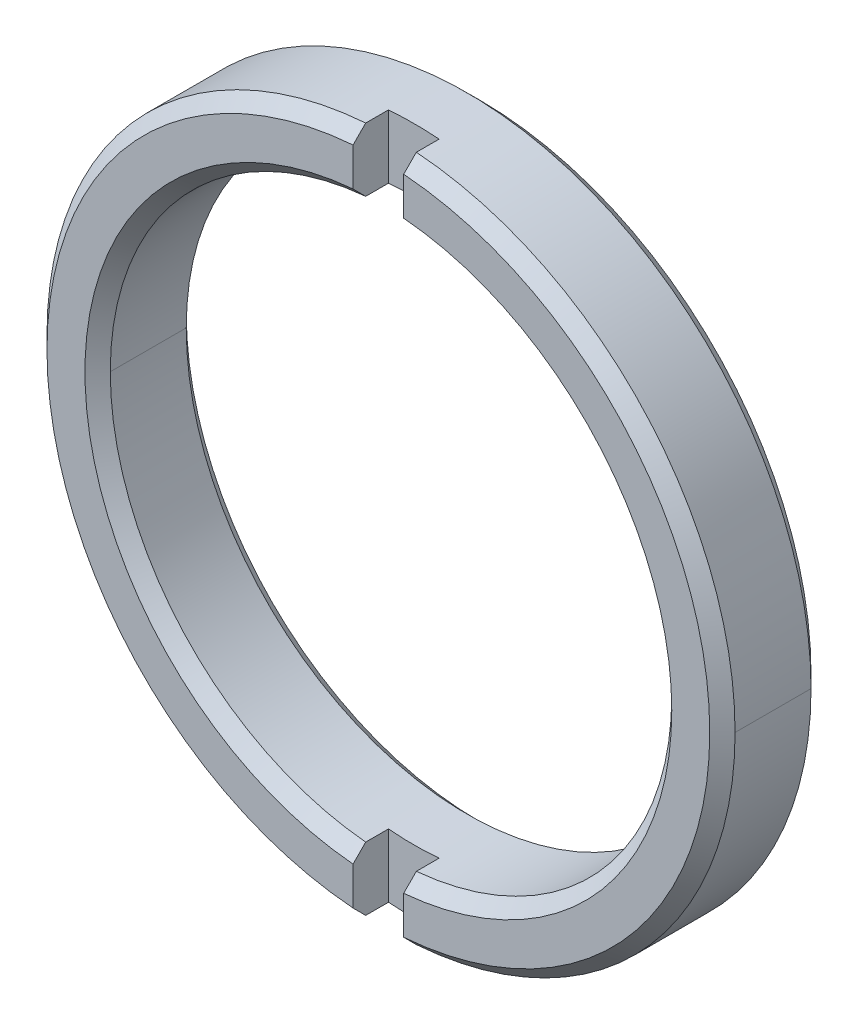
ISO-10303-21;
HEADER;
FILE_DESCRIPTION(('STEP AP214'),'2;1');
FILE_NAME('part.step','',(''),(''),'','','');
FILE_SCHEMA(('AUTOMOTIVE_DESIGN { 1 0 10303 214 1 1 1 1 }'));
ENDSEC;
DATA;
#1=APPLICATION_CONTEXT('core data for automotive mechanical design processes');
#2=APPLICATION_PROTOCOL_DEFINITION('international standard','automotive_design',2000,#1);
#3=PRODUCT_CONTEXT('',#1,'mechanical');
#4=PRODUCT('Part','Part','',(#3));
#5=PRODUCT_RELATED_PRODUCT_CATEGORY('part','',(#4));
#6=PRODUCT_DEFINITION_FORMATION('','',#4);
#7=PRODUCT_DEFINITION_CONTEXT('part definition',#1,'design');
#8=PRODUCT_DEFINITION('design','',#6,#7);
#9=PRODUCT_DEFINITION_SHAPE('','',#8);
#10=(LENGTH_UNIT() NAMED_UNIT(*) SI_UNIT(.MILLI.,.METRE.));
#11=(NAMED_UNIT(*) PLANE_ANGLE_UNIT() SI_UNIT($,.RADIAN.));
#12=(NAMED_UNIT(*) SI_UNIT($,.STERADIAN.) SOLID_ANGLE_UNIT());
#13=UNCERTAINTY_MEASURE_WITH_UNIT(LENGTH_MEASURE(1.E-05),#10,'distance_accuracy_value','');
#14=(GEOMETRIC_REPRESENTATION_CONTEXT(3) GLOBAL_UNCERTAINTY_ASSIGNED_CONTEXT((#13)) GLOBAL_UNIT_ASSIGNED_CONTEXT((#10,
#11,#12)) REPRESENTATION_CONTEXT('',''));
#15=CARTESIAN_POINT('',(0.,0.,0.));
#16=DIRECTION('',(0.,0.,1.));
#17=DIRECTION('',(1.,0.,0.));
#18=AXIS2_PLACEMENT_3D('',#15,#16,#17);
#19=CARTESIAN_POINT('',(-0.500000000000007,55.,1.3));
#20=DIRECTION('',(-1.,0.,0.));
#21=DIRECTION('',(0.,1.,0.));
#22=AXIS2_PLACEMENT_3D('',#19,#20,#21);
#23=PLANE('',#22);
#24=DIRECTION('',(0.,0.,-1.));
#25=VECTOR('',#24,1.);
#26=CARTESIAN_POINT('',(-0.5,5.52190911279786,2.));
#27=LINE('',#26,#25);
#28=CARTESIAN_POINT('',(-0.5,5.52190911279786,1.75));
#29=VERTEX_POINT('',#28);
#30=CARTESIAN_POINT('',(-0.5,5.52190911279786,1.3));
#31=VERTEX_POINT('',#30);
#32=EDGE_CURVE('E257',#29,#31,#27,.T.);
#33=ORIENTED_EDGE('',*,*,#32,.T.);
#34=DIRECTION('',(0.,-1.,0.));
#35=VECTOR('',#34,1.);
#36=CARTESIAN_POINT('',(-0.500000000000007,55.,1.3));
#37=LINE('',#36,#35);
#38=CARTESIAN_POINT('',(-0.5,6.77607779249914,1.3));
#39=VERTEX_POINT('',#38);
#40=EDGE_CURVE('E25',#39,#31,#37,.T.);
#41=ORIENTED_EDGE('',*,*,#40,.F.);
#42=DIRECTION('',(0.,0.,-1.));
#43=VECTOR('',#42,1.);
#44=CARTESIAN_POINT('',(-0.5,6.77607779249914,2.));
#45=LINE('',#44,#43);
#46=CARTESIAN_POINT('',(-0.5,6.77607779249914,1.75));
#47=VERTEX_POINT('',#46);
#48=EDGE_CURVE('E183',#47,#39,#45,.T.);
#49=ORIENTED_EDGE('',*,*,#48,.F.);
#50=CARTESIAN_POINT('',(-0.5,6.77607779249914,1.75));
#51=CARTESIAN_POINT('',(-0.5,6.69251354093146,1.83333768037303));
#52=CARTESIAN_POINT('',(-0.5,6.60894512249002,1.91667118024032));
#53=CARTESIAN_POINT('',(-0.5,6.52537203920206,2.));
#54=(BOUNDED_CURVE() B_SPLINE_CURVE(3,(#50,#51,#52,#53),.UNSPECIFIED.,.F.,
.F.) B_SPLINE_CURVE_WITH_KNOTS((4,4),(0.011539991428633,0.011894044205025),
.UNSPECIFIED.) CURVE() GEOMETRIC_REPRESENTATION_ITEM() RATIONAL_B_SPLINE_CURVE((1.,1.,1.,1.)) REPRESENTATION_ITEM(''));
#55=CARTESIAN_POINT('',(-0.5,6.52537203920206,2.));
#56=VERTEX_POINT('',#55);
#57=EDGE_CURVE('E178',#47,#56,#54,.T.);
#58=ORIENTED_EDGE('',*,*,#57,.T.);
#59=DIRECTION('',(0.,-1.,0.));
#60=VECTOR('',#59,1.);
#61=CARTESIAN_POINT('',(-0.500000000000007,55.,2.));
#62=LINE('',#61,#60);
#63=CARTESIAN_POINT('',(-0.5,5.77288751406088,2.));
#64=VERTEX_POINT('',#63);
#65=EDGE_CURVE('E181',#56,#64,#62,.T.);
#66=ORIENTED_EDGE('',*,*,#65,.T.);
#67=CARTESIAN_POINT('',(-0.5,5.77288751406088,2.));
#68=CARTESIAN_POINT('',(-0.5,5.68923509342954,1.91665958847465));
#69=CARTESIAN_POINT('',(-0.5,5.60557594533339,1.83332593471311));
#70=CARTESIAN_POINT('',(-0.5,5.52190911279786,1.75));
#71=(BOUNDED_CURVE() B_SPLINE_CURVE(3,(#67,#68,#69,#70),.UNSPECIFIED.,.F.,
.F.) B_SPLINE_CURVE_WITH_KNOTS((4,4),(0.00984450423718629,0.0101987501222222),
.UNSPECIFIED.) CURVE() GEOMETRIC_REPRESENTATION_ITEM() RATIONAL_B_SPLINE_CURVE((1.,1.,1.,1.)) REPRESENTATION_ITEM(''));
#72=EDGE_CURVE('E40',#64,#29,#71,.T.);
#73=ORIENTED_EDGE('',*,*,#72,.T.);
#74=EDGE_LOOP('',(#33,#41,#49,#58,#66,#73));
#75=FACE_BOUND('',#74,.T.);
#76=ADVANCED_FACE('F14',(#75),#23,.F.);
#77=CARTESIAN_POINT('',(0.499999999999993,55.,1.3));
#78=DIRECTION('',(1.,0.,0.));
#79=DIRECTION('',(0.,1.,0.));
#80=AXIS2_PLACEMENT_3D('',#77,#78,#79);
#81=PLANE('',#80);
#82=DIRECTION('',(0.,0.,1.));
#83=VECTOR('',#82,1.);
#84=CARTESIAN_POINT('',(0.5,5.52190911279786,2.));
#85=LINE('',#84,#83);
#86=CARTESIAN_POINT('',(0.5,5.52190911279786,1.3));
#87=VERTEX_POINT('',#86);
#88=CARTESIAN_POINT('',(0.5,5.52190911279786,1.75));
#89=VERTEX_POINT('',#88);
#90=EDGE_CURVE('E368',#87,#89,#85,.T.);
#91=ORIENTED_EDGE('',*,*,#90,.T.);
#92=CARTESIAN_POINT('',(0.5,5.52190911279786,1.75));
#93=CARTESIAN_POINT('',(0.5,5.60557594889368,1.83332593825891));
#94=CARTESIAN_POINT('',(0.5,5.68923509683505,1.91665959186746));
#95=CARTESIAN_POINT('',(0.5,5.77288751406088,2.));
#96=(BOUNDED_CURVE() B_SPLINE_CURVE(3,(#92,#93,#94,#95),.UNSPECIFIED.,.F.,
.F.) B_SPLINE_CURVE_WITH_KNOTS((4,4),(0.0252588448888443,0.025613630062761),
.UNSPECIFIED.) CURVE() GEOMETRIC_REPRESENTATION_ITEM() RATIONAL_B_SPLINE_CURVE((1.,1.,1.,1.)) REPRESENTATION_ITEM(''));
#97=CARTESIAN_POINT('',(0.5,5.77288751406088,2.));
#98=VERTEX_POINT('',#97);
#99=EDGE_CURVE('E224',#89,#98,#96,.T.);
#100=ORIENTED_EDGE('',*,*,#99,.T.);
#101=DIRECTION('',(0.,1.,0.));
#102=VECTOR('',#101,1.);
#103=CARTESIAN_POINT('',(0.499999999999993,55.,2.));
#104=LINE('',#103,#102);
#105=CARTESIAN_POINT('',(0.5,6.52537203920206,2.));
#106=VERTEX_POINT('',#105);
#107=EDGE_CURVE('E316',#98,#106,#104,.T.);
#108=ORIENTED_EDGE('',*,*,#107,.T.);
#109=CARTESIAN_POINT('',(0.5,6.52537203920206,2.));
#110=CARTESIAN_POINT('',(0.5,6.60894512643388,1.916671176308));
#111=CARTESIAN_POINT('',(0.5,6.6925135447294,1.83333767658539));
#112=CARTESIAN_POINT('',(0.5,6.77607779249914,1.75));
#113=(BOUNDED_CURVE() B_SPLINE_CURVE(3,(#109,#110,#111,#112),.UNSPECIFIED.,.F.,
.F.) B_SPLINE_CURVE_WITH_KNOTS((4,4),(0.0297927476213285,0.0301474759784899),
.UNSPECIFIED.) CURVE() GEOMETRIC_REPRESENTATION_ITEM() RATIONAL_B_SPLINE_CURVE((1.,1.,1.,1.)) REPRESENTATION_ITEM(''));
#114=CARTESIAN_POINT('',(0.5,6.77607779249914,1.75));
#115=VERTEX_POINT('',#114);
#116=EDGE_CURVE('E208',#106,#115,#113,.T.);
#117=ORIENTED_EDGE('',*,*,#116,.T.);
#118=DIRECTION('',(0.,0.,1.));
#119=VECTOR('',#118,1.);
#120=CARTESIAN_POINT('',(0.5,6.77607779249914,2.));
#121=LINE('',#120,#119);
#122=CARTESIAN_POINT('',(0.5,6.77607779249914,1.3));
#123=VERTEX_POINT('',#122);
#124=EDGE_CURVE('E429',#123,#115,#121,.T.);
#125=ORIENTED_EDGE('',*,*,#124,.F.);
#126=DIRECTION('',(0.,1.,0.));
#127=VECTOR('',#126,1.);
#128=CARTESIAN_POINT('',(0.499999999999993,55.,1.3));
#129=LINE('',#128,#127);
#130=EDGE_CURVE('E9',#87,#123,#129,.T.);
#131=ORIENTED_EDGE('',*,*,#130,.F.);
#132=EDGE_LOOP('',(#91,#100,#108,#117,#125,#131));
#133=FACE_BOUND('',#132,.T.);
#134=ADVANCED_FACE('F597',(#133),#81,.F.);
#135=CARTESIAN_POINT('',(0.,0.,1.3));
#136=DIRECTION('',(0.,0.,1.));
#137=DIRECTION('',(1.,0.,0.));
#138=AXIS2_PLACEMENT_3D('',#135,#136,#137);
#139=PLANE('',#138);
#140=CARTESIAN_POINT('',(0.,0.,1.3));
#141=DIRECTION('',(0.,0.,1.));
#142=DIRECTION('',(1.,0.,0.));
#143=AXIS2_PLACEMENT_3D('',#140,#141,#142);
#144=CIRCLE('',#143,6.7945);
#145=EDGE_CURVE('E426',#123,#39,#144,.T.);
#146=ORIENTED_EDGE('',*,*,#145,.T.);
#147=ORIENTED_EDGE('',*,*,#40,.T.);
#148=CARTESIAN_POINT('',(0.,0.,1.3));
#149=DIRECTION('',(0.,0.,1.));
#150=DIRECTION('',(1.,0.,0.));
#151=AXIS2_PLACEMENT_3D('',#148,#149,#150);
#152=CIRCLE('',#151,5.5445);
#153=EDGE_CURVE('E310',#87,#31,#152,.T.);
#154=ORIENTED_EDGE('',*,*,#153,.F.);
#155=ORIENTED_EDGE('',*,*,#130,.T.);
#156=EDGE_LOOP('',(#146,#147,#154,#155));
#157=FACE_BOUND('',#156,.T.);
#158=ADVANCED_FACE('F573',(#157),#139,.T.);
#159=CARTESIAN_POINT('',(0.,0.,1.3));
#160=DIRECTION('',(0.,0.,1.));
#161=DIRECTION('',(1.,0.,0.));
#162=AXIS2_PLACEMENT_3D('',#159,#160,#161);
#163=PLANE('',#162);
#164=CARTESIAN_POINT('',(0.,0.,1.3));
#165=DIRECTION('',(0.,0.,1.));
#166=DIRECTION('',(1.,0.,0.));
#167=AXIS2_PLACEMENT_3D('',#164,#165,#166);
#168=CIRCLE('',#167,6.7945);
#169=CARTESIAN_POINT('',(-0.5,-6.77607779249914,1.3));
#170=VERTEX_POINT('',#169);
#171=CARTESIAN_POINT('',(0.5,-6.77607779249914,1.3));
#172=VERTEX_POINT('',#171);
#173=EDGE_CURVE('E425',#170,#172,#168,.T.);
#174=ORIENTED_EDGE('',*,*,#173,.T.);
#175=DIRECTION('',(0.,1.,0.));
#176=VECTOR('',#175,1.);
#177=CARTESIAN_POINT('',(0.499999999999993,55.,1.3));
#178=LINE('',#177,#176);
#179=CARTESIAN_POINT('',(0.5,-5.52190911279786,1.3));
#180=VERTEX_POINT('',#179);
#181=EDGE_CURVE('E187',#172,#180,#178,.T.);
#182=ORIENTED_EDGE('',*,*,#181,.T.);
#183=CARTESIAN_POINT('',(0.,0.,1.3));
#184=DIRECTION('',(0.,0.,1.));
#185=DIRECTION('',(1.,0.,0.));
#186=AXIS2_PLACEMENT_3D('',#183,#184,#185);
#187=CIRCLE('',#186,5.5445);
#188=CARTESIAN_POINT('',(-0.5,-5.52190911279786,1.3));
#189=VERTEX_POINT('',#188);
#190=EDGE_CURVE('E300',#189,#180,#187,.T.);
#191=ORIENTED_EDGE('',*,*,#190,.F.);
#192=DIRECTION('',(0.,-1.,0.));
#193=VECTOR('',#192,1.);
#194=CARTESIAN_POINT('',(-0.500000000000007,55.,1.3));
#195=LINE('',#194,#193);
#196=EDGE_CURVE('E227',#189,#170,#195,.T.);
#197=ORIENTED_EDGE('',*,*,#196,.T.);
#198=EDGE_LOOP('',(#174,#182,#191,#197));
#199=FACE_BOUND('',#198,.T.);
#200=ADVANCED_FACE('F568',(#199),#163,.T.);
#201=CARTESIAN_POINT('',(-0.500000000000007,55.,1.3));
#202=DIRECTION('',(-1.,0.,0.));
#203=DIRECTION('',(0.,1.,0.));
#204=AXIS2_PLACEMENT_3D('',#201,#202,#203);
#205=PLANE('',#204);
#206=DIRECTION('',(0.,0.,1.));
#207=VECTOR('',#206,1.);
#208=CARTESIAN_POINT('',(-0.5,-5.52190911279786,2.));
#209=LINE('',#208,#207);
#210=CARTESIAN_POINT('',(-0.5,-5.52190911279786,1.75));
#211=VERTEX_POINT('',#210);
#212=EDGE_CURVE('E289',#189,#211,#209,.T.);
#213=ORIENTED_EDGE('',*,*,#212,.T.);
#214=CARTESIAN_POINT('',(-0.5,-5.52190911279786,1.75));
#215=CARTESIAN_POINT('',(-0.5,-5.60557594889368,1.83332593825891));
#216=CARTESIAN_POINT('',(-0.5,-5.68923509683505,1.91665959186746));
#217=CARTESIAN_POINT('',(-0.5,-5.77288751406088,2.));
#218=(BOUNDED_CURVE() B_SPLINE_CURVE(3,(#214,#215,#216,#217),.UNSPECIFIED.,.F.,
.F.) B_SPLINE_CURVE_WITH_KNOTS((4,4),(0.0252588448888443,0.025613630062761),
.UNSPECIFIED.) CURVE() GEOMETRIC_REPRESENTATION_ITEM() RATIONAL_B_SPLINE_CURVE((1.,1.,1.,1.)) REPRESENTATION_ITEM(''));
#219=CARTESIAN_POINT('',(-0.5,-5.77288751406088,2.));
#220=VERTEX_POINT('',#219);
#221=EDGE_CURVE('E188',#211,#220,#218,.T.);
#222=ORIENTED_EDGE('',*,*,#221,.T.);
#223=DIRECTION('',(0.,-1.,0.));
#224=VECTOR('',#223,1.);
#225=CARTESIAN_POINT('',(-0.500000000000007,55.,2.));
#226=LINE('',#225,#224);
#227=CARTESIAN_POINT('',(-0.5,-6.52537203920206,2.));
#228=VERTEX_POINT('',#227);
#229=EDGE_CURVE('E200',#220,#228,#226,.T.);
#230=ORIENTED_EDGE('',*,*,#229,.T.);
#231=CARTESIAN_POINT('',(-0.5,-6.52537203920206,2.));
#232=CARTESIAN_POINT('',(-0.5,-6.60894512643388,1.916671176308));
#233=CARTESIAN_POINT('',(-0.5,-6.6925135447294,1.83333767658539));
#234=CARTESIAN_POINT('',(-0.5,-6.77607779249914,1.75));
#235=(BOUNDED_CURVE() B_SPLINE_CURVE(3,(#231,#232,#233,#234),.UNSPECIFIED.,.F.,
.F.) B_SPLINE_CURVE_WITH_KNOTS((4,4),(0.0297927476213285,0.0301474759784899),
.UNSPECIFIED.) CURVE() GEOMETRIC_REPRESENTATION_ITEM() RATIONAL_B_SPLINE_CURVE((1.,1.,1.,1.)) REPRESENTATION_ITEM(''));
#236=CARTESIAN_POINT('',(-0.5,-6.77607779249914,1.75));
#237=VERTEX_POINT('',#236);
#238=EDGE_CURVE('E336',#228,#237,#235,.T.);
#239=ORIENTED_EDGE('',*,*,#238,.T.);
#240=DIRECTION('',(0.,0.,1.));
#241=VECTOR('',#240,1.);
#242=CARTESIAN_POINT('',(-0.5,-6.77607779249914,2.));
#243=LINE('',#242,#241);
#244=EDGE_CURVE('E401',#170,#237,#243,.T.);
#245=ORIENTED_EDGE('',*,*,#244,.F.);
#246=ORIENTED_EDGE('',*,*,#196,.F.);
#247=EDGE_LOOP('',(#213,#222,#230,#239,#245,#246));
#248=FACE_BOUND('',#247,.T.);
#249=ADVANCED_FACE('F572',(#248),#205,.F.);
#250=CARTESIAN_POINT('',(0.499999999999993,55.,1.3));
#251=DIRECTION('',(1.,0.,0.));
#252=DIRECTION('',(0.,1.,0.));
#253=AXIS2_PLACEMENT_3D('',#250,#251,#252);
#254=PLANE('',#253);
#255=DIRECTION('',(0.,0.,-1.));
#256=VECTOR('',#255,1.);
#257=CARTESIAN_POINT('',(0.5,-5.52190911279786,2.));
#258=LINE('',#257,#256);
#259=CARTESIAN_POINT('',(0.5,-5.52190911279786,1.75));
#260=VERTEX_POINT('',#259);
#261=EDGE_CURVE('E374',#260,#180,#258,.T.);
#262=ORIENTED_EDGE('',*,*,#261,.T.);
#263=ORIENTED_EDGE('',*,*,#181,.F.);
#264=DIRECTION('',(0.,0.,-1.));
#265=VECTOR('',#264,1.);
#266=CARTESIAN_POINT('',(0.5,-6.77607779249914,2.));
#267=LINE('',#266,#265);
#268=CARTESIAN_POINT('',(0.5,-6.77607779249914,1.75));
#269=VERTEX_POINT('',#268);
#270=EDGE_CURVE('E420',#269,#172,#267,.T.);
#271=ORIENTED_EDGE('',*,*,#270,.F.);
#272=CARTESIAN_POINT('',(0.5,-6.77607779249914,1.75));
#273=CARTESIAN_POINT('',(0.5,-6.69251354093146,1.83333768037303));
#274=CARTESIAN_POINT('',(0.5,-6.60894512249002,1.91667118024032));
#275=CARTESIAN_POINT('',(0.5,-6.52537203920206,2.));
#276=(BOUNDED_CURVE() B_SPLINE_CURVE(3,(#272,#273,#274,#275),.UNSPECIFIED.,.F.,
.F.) B_SPLINE_CURVE_WITH_KNOTS((4,4),(0.011539991428633,0.011894044205025),
.UNSPECIFIED.) CURVE() GEOMETRIC_REPRESENTATION_ITEM() RATIONAL_B_SPLINE_CURVE((1.,1.,1.,1.)) REPRESENTATION_ITEM(''));
#277=CARTESIAN_POINT('',(0.5,-6.52537203920206,2.));
#278=VERTEX_POINT('',#277);
#279=EDGE_CURVE('E317',#269,#278,#276,.T.);
#280=ORIENTED_EDGE('',*,*,#279,.T.);
#281=DIRECTION('',(0.,1.,0.));
#282=VECTOR('',#281,1.);
#283=CARTESIAN_POINT('',(0.499999999999993,55.,2.));
#284=LINE('',#283,#282);
#285=CARTESIAN_POINT('',(0.5,-5.77288751406088,2.));
#286=VERTEX_POINT('',#285);
#287=EDGE_CURVE('E229',#278,#286,#284,.T.);
#288=ORIENTED_EDGE('',*,*,#287,.T.);
#289=CARTESIAN_POINT('',(0.5,-5.77288751406088,2.));
#290=CARTESIAN_POINT('',(0.5,-5.68923509342954,1.91665958847465));
#291=CARTESIAN_POINT('',(0.5,-5.60557594533339,1.83332593471311));
#292=CARTESIAN_POINT('',(0.5,-5.52190911279786,1.75));
#293=(BOUNDED_CURVE() B_SPLINE_CURVE(3,(#289,#290,#291,#292),.UNSPECIFIED.,.F.,
.F.) B_SPLINE_CURVE_WITH_KNOTS((4,4),(0.00984450423718629,0.0101987501222222),
.UNSPECIFIED.) CURVE() GEOMETRIC_REPRESENTATION_ITEM() RATIONAL_B_SPLINE_CURVE((1.,1.,1.,1.)) REPRESENTATION_ITEM(''));
#294=EDGE_CURVE('E315',#286,#260,#293,.T.);
#295=ORIENTED_EDGE('',*,*,#294,.T.);
#296=EDGE_LOOP('',(#262,#263,#271,#280,#288,#295));
#297=FACE_BOUND('',#296,.T.);
#298=ADVANCED_FACE('F619',(#297),#254,.F.);
#299=CARTESIAN_POINT('',(0.,0.,2.));
#300=DIRECTION('',(0.,0.,-1.));
#301=DIRECTION('',(-1.,0.,0.));
#302=AXIS2_PLACEMENT_3D('',#299,#300,#301);
#303=CONICAL_SURFACE('',#302,6.5445,0.78539816339745);
#304=DIRECTION('',(-0.707106781186549,0.,-0.707106781186546));
#305=VECTOR('',#304,1.);
#306=CARTESIAN_POINT('',(-6.5445,0.,2.));
#307=LINE('',#306,#305);
#308=CARTESIAN_POINT('',(-6.5445,0.,2.));
#309=VERTEX_POINT('',#308);
#310=CARTESIAN_POINT('',(-6.7945,0.,1.75));
#311=VERTEX_POINT('',#310);
#312=EDGE_CURVE('E195',#309,#311,#307,.T.);
#313=ORIENTED_EDGE('',*,*,#312,.F.);
#314=CARTESIAN_POINT('',(0.,0.,2.));
#315=DIRECTION('',(0.,0.,1.));
#316=DIRECTION('',(1.,0.,0.));
#317=AXIS2_PLACEMENT_3D('',#314,#315,#316);
#318=CIRCLE('',#317,6.5445);
#319=EDGE_CURVE('E192',#56,#309,#318,.T.);
#320=ORIENTED_EDGE('',*,*,#319,.F.);
#321=ORIENTED_EDGE('',*,*,#57,.F.);
#322=CARTESIAN_POINT('',(0.,0.,1.75));
#323=DIRECTION('',(0.,0.,-1.));
#324=DIRECTION('',(1.,0.,0.));
#325=AXIS2_PLACEMENT_3D('',#322,#323,#324);
#326=CIRCLE('',#325,6.7945);
#327=EDGE_CURVE('E355',#311,#47,#326,.T.);
#328=ORIENTED_EDGE('',*,*,#327,.F.);
#329=EDGE_LOOP('',(#313,#320,#321,#328));
#330=FACE_BOUND('',#329,.T.);
#331=ADVANCED_FACE('F193',(#330),#303,.T.);
#332=CARTESIAN_POINT('',(0.,0.,0.25));
#333=DIRECTION('',(0.,0.,1.));
#334=DIRECTION('',(1.,0.,0.));
#335=AXIS2_PLACEMENT_3D('',#332,#333,#334);
#336=CONICAL_SURFACE('',#335,6.7945,0.78539816339745);
#337=DIRECTION('',(-0.707106781186549,0.,0.707106781186546));
#338=VECTOR('',#337,1.);
#339=CARTESIAN_POINT('',(-6.7945,0.,0.25));
#340=LINE('',#339,#338);
#341=CARTESIAN_POINT('',(-6.5445,0.,0.));
#342=VERTEX_POINT('',#341);
#343=CARTESIAN_POINT('',(-6.7945,0.,0.25));
#344=VERTEX_POINT('',#343);
#345=EDGE_CURVE('E267',#342,#344,#340,.T.);
#346=ORIENTED_EDGE('',*,*,#345,.F.);
#347=CARTESIAN_POINT('',(0.,0.,0.));
#348=DIRECTION('',(0.,0.,-1.));
#349=DIRECTION('',(1.,0.,0.));
#350=AXIS2_PLACEMENT_3D('',#347,#348,#349);
#351=CIRCLE('',#350,6.5445);
#352=CARTESIAN_POINT('',(6.5445,0.,0.));
#353=VERTEX_POINT('',#352);
#354=EDGE_CURVE('E356',#353,#342,#351,.T.);
#355=ORIENTED_EDGE('',*,*,#354,.F.);
#356=DIRECTION('',(0.707106781186549,0.,0.707106781186546));
#357=VECTOR('',#356,1.);
#358=CARTESIAN_POINT('',(6.7945,0.,0.25));
#359=LINE('',#358,#357);
#360=CARTESIAN_POINT('',(6.7945,0.,0.25));
#361=VERTEX_POINT('',#360);
#362=EDGE_CURVE('E266',#353,#361,#359,.T.);
#363=ORIENTED_EDGE('',*,*,#362,.T.);
#364=CARTESIAN_POINT('',(0.,0.,0.25));
#365=DIRECTION('',(0.,0.,1.));
#366=DIRECTION('',(1.,0.,0.));
#367=AXIS2_PLACEMENT_3D('',#364,#365,#366);
#368=CIRCLE('',#367,6.7945);
#369=EDGE_CURVE('E396',#344,#361,#368,.T.);
#370=ORIENTED_EDGE('',*,*,#369,.F.);
#371=EDGE_LOOP('',(#346,#355,#363,#370));
#372=FACE_BOUND('',#371,.T.);
#373=ADVANCED_FACE('F588',(#372),#336,.T.);
#374=CARTESIAN_POINT('',(0.,0.,0.));
#375=DIRECTION('',(0.,0.,-1.));
#376=DIRECTION('',(-1.,0.,0.));
#377=AXIS2_PLACEMENT_3D('',#374,#375,#376);
#378=CONICAL_SURFACE('',#377,5.7945,0.785398163397448);
#379=DIRECTION('',(0.707106781186548,0.,-0.707106781186548));
#380=VECTOR('',#379,1.);
#381=CARTESIAN_POINT('',(5.7945,0.,0.));
#382=LINE('',#381,#380);
#383=CARTESIAN_POINT('',(5.5445,0.,0.25));
#384=VERTEX_POINT('',#383);
#385=CARTESIAN_POINT('',(5.7945,0.,0.));
#386=VERTEX_POINT('',#385);
#387=EDGE_CURVE('E335',#384,#386,#382,.T.);
#388=ORIENTED_EDGE('',*,*,#387,.F.);
#389=CARTESIAN_POINT('',(0.,0.,0.25));
#390=DIRECTION('',(0.,0.,-1.));
#391=DIRECTION('',(1.,0.,0.));
#392=AXIS2_PLACEMENT_3D('',#389,#390,#391);
#393=CIRCLE('',#392,5.5445);
#394=CARTESIAN_POINT('',(-5.5445,0.,0.25));
#395=VERTEX_POINT('',#394);
#396=EDGE_CURVE('E236',#395,#384,#393,.T.);
#397=ORIENTED_EDGE('',*,*,#396,.F.);
#398=DIRECTION('',(-0.707106781186548,0.,-0.707106781186548));
#399=VECTOR('',#398,1.);
#400=CARTESIAN_POINT('',(-5.7945,0.,0.));
#401=LINE('',#400,#399);
#402=CARTESIAN_POINT('',(-5.7945,0.,0.));
#403=VERTEX_POINT('',#402);
#404=EDGE_CURVE('E334',#395,#403,#401,.T.);
#405=ORIENTED_EDGE('',*,*,#404,.T.);
#406=CARTESIAN_POINT('',(0.,0.,0.));
#407=DIRECTION('',(0.,0.,1.));
#408=DIRECTION('',(1.,0.,0.));
#409=AXIS2_PLACEMENT_3D('',#406,#407,#408);
#410=CIRCLE('',#409,5.7945);
#411=EDGE_CURVE('E359',#386,#403,#410,.T.);
#412=ORIENTED_EDGE('',*,*,#411,.F.);
#413=EDGE_LOOP('',(#388,#397,#405,#412));
#414=FACE_BOUND('',#413,.T.);
#415=ADVANCED_FACE('F16',(#414),#378,.F.);
#416=CARTESIAN_POINT('',(0.,0.,1.75));
#417=DIRECTION('',(0.,0.,1.));
#418=DIRECTION('',(1.,0.,0.));
#419=AXIS2_PLACEMENT_3D('',#416,#417,#418);
#420=CONICAL_SURFACE('',#419,5.5445,0.785398163397448);
#421=ORIENTED_EDGE('',*,*,#72,.F.);
#422=CARTESIAN_POINT('',(0.,0.,2.));
#423=DIRECTION('',(0.,0.,-1.));
#424=DIRECTION('',(1.,0.,0.));
#425=AXIS2_PLACEMENT_3D('',#422,#423,#424);
#426=CIRCLE('',#425,5.7945);
#427=EDGE_CURVE('E206',#220,#64,#426,.T.);
#428=ORIENTED_EDGE('',*,*,#427,.F.);
#429=ORIENTED_EDGE('',*,*,#221,.F.);
#430=CARTESIAN_POINT('',(0.,0.,1.75));
#431=DIRECTION('',(0.,0.,1.));
#432=DIRECTION('',(1.,0.,0.));
#433=AXIS2_PLACEMENT_3D('',#430,#431,#432);
#434=CIRCLE('',#433,5.5445);
#435=CARTESIAN_POINT('',(-5.5445,0.,1.75));
#436=VERTEX_POINT('',#435);
#437=EDGE_CURVE('E282',#436,#211,#434,.T.);
#438=ORIENTED_EDGE('',*,*,#437,.F.);
#439=CARTESIAN_POINT('',(0.,0.,1.75));
#440=DIRECTION('',(0.,0.,1.));
#441=DIRECTION('',(1.,0.,0.));
#442=AXIS2_PLACEMENT_3D('',#439,#440,#441);
#443=CIRCLE('',#442,5.5445);
#444=EDGE_CURVE('E246',#29,#436,#443,.T.);
#445=ORIENTED_EDGE('',*,*,#444,.F.);
#446=EDGE_LOOP('',(#421,#428,#429,#438,#445));
#447=FACE_BOUND('',#446,.T.);
#448=ADVANCED_FACE('F606',(#447),#420,.F.);
#449=CARTESIAN_POINT('',(0.,0.,2.));
#450=DIRECTION('',(0.,0.,-1.));
#451=DIRECTION('',(-1.,0.,0.));
#452=AXIS2_PLACEMENT_3D('',#449,#450,#451);
#453=CYLINDRICAL_SURFACE('',#452,5.5445);
#454=DIRECTION('',(0.,0.,-1.));
#455=VECTOR('',#454,1.);
#456=CARTESIAN_POINT('',(5.5445,0.,2.));
#457=LINE('',#456,#455);
#458=CARTESIAN_POINT('',(5.5445,0.,1.75));
#459=VERTEX_POINT('',#458);
#460=EDGE_CURVE('E278',#459,#384,#457,.T.);
#461=ORIENTED_EDGE('',*,*,#460,.F.);
#462=CARTESIAN_POINT('',(0.,0.,1.75));
#463=DIRECTION('',(0.,0.,1.));
#464=DIRECTION('',(1.,0.,0.));
#465=AXIS2_PLACEMENT_3D('',#462,#463,#464);
#466=CIRCLE('',#465,5.5445);
#467=EDGE_CURVE('E261',#459,#89,#466,.T.);
#468=ORIENTED_EDGE('',*,*,#467,.T.);
#469=ORIENTED_EDGE('',*,*,#90,.F.);
#470=ORIENTED_EDGE('',*,*,#153,.T.);
#471=ORIENTED_EDGE('',*,*,#32,.F.);
#472=ORIENTED_EDGE('',*,*,#444,.T.);
#473=DIRECTION('',(0.,0.,-1.));
#474=VECTOR('',#473,1.);
#475=CARTESIAN_POINT('',(-5.5445,0.,2.));
#476=LINE('',#475,#474);
#477=EDGE_CURVE('E280',#436,#395,#476,.T.);
#478=ORIENTED_EDGE('',*,*,#477,.T.);
#479=ORIENTED_EDGE('',*,*,#396,.T.);
#480=EDGE_LOOP('',(#461,#468,#469,#470,#471,#472,#478,#479));
#481=FACE_BOUND('',#480,.T.);
#482=ADVANCED_FACE('F610',(#481),#453,.F.);
#483=CARTESIAN_POINT('',(0.,0.,2.));
#484=DIRECTION('',(0.,0.,-1.));
#485=DIRECTION('',(-1.,0.,0.));
#486=AXIS2_PLACEMENT_3D('',#483,#484,#485);
#487=CYLINDRICAL_SURFACE('',#486,6.7945);
#488=DIRECTION('',(0.,0.,-1.));
#489=VECTOR('',#488,1.);
#490=CARTESIAN_POINT('',(6.7945,0.,2.));
#491=LINE('',#490,#489);
#492=CARTESIAN_POINT('',(6.7945,0.,1.75));
#493=VERTEX_POINT('',#492);
#494=EDGE_CURVE('E272',#493,#361,#491,.T.);
#495=ORIENTED_EDGE('',*,*,#494,.F.);
#496=CARTESIAN_POINT('',(0.,0.,1.75));
#497=DIRECTION('',(0.,0.,-1.));
#498=DIRECTION('',(1.,0.,0.));
#499=AXIS2_PLACEMENT_3D('',#496,#497,#498);
#500=CIRCLE('',#499,6.7945);
#501=EDGE_CURVE('E215',#493,#269,#500,.T.);
#502=ORIENTED_EDGE('',*,*,#501,.T.);
#503=ORIENTED_EDGE('',*,*,#270,.T.);
#504=ORIENTED_EDGE('',*,*,#173,.F.);
#505=ORIENTED_EDGE('',*,*,#244,.T.);
#506=CARTESIAN_POINT('',(0.,0.,1.75));
#507=DIRECTION('',(0.,0.,-1.));
#508=DIRECTION('',(1.,0.,0.));
#509=AXIS2_PLACEMENT_3D('',#506,#507,#508);
#510=CIRCLE('',#509,6.7945);
#511=EDGE_CURVE('E342',#237,#311,#510,.T.);
#512=ORIENTED_EDGE('',*,*,#511,.T.);
#513=DIRECTION('',(0.,0.,-1.));
#514=VECTOR('',#513,1.);
#515=CARTESIAN_POINT('',(-6.7945,0.,2.));
#516=LINE('',#515,#514);
#517=EDGE_CURVE('E276',#311,#344,#516,.T.);
#518=ORIENTED_EDGE('',*,*,#517,.T.);
#519=ORIENTED_EDGE('',*,*,#369,.T.);
#520=EDGE_LOOP('',(#495,#502,#503,#504,#505,#512,#518,#519));
#521=FACE_BOUND('',#520,.T.);
#522=ADVANCED_FACE('F656',(#521),#487,.T.);
#523=CARTESIAN_POINT('',(0.,0.,0.));
#524=DIRECTION('',(0.,0.,1.));
#525=DIRECTION('',(1.,0.,0.));
#526=AXIS2_PLACEMENT_3D('',#523,#524,#525);
#527=PLANE('',#526);
#528=CARTESIAN_POINT('',(0.,0.,0.));
#529=DIRECTION('',(0.,0.,1.));
#530=DIRECTION('',(1.,0.,0.));
#531=AXIS2_PLACEMENT_3D('',#528,#529,#530);
#532=CIRCLE('',#531,5.7945);
#533=EDGE_CURVE('E327',#403,#386,#532,.T.);
#534=ORIENTED_EDGE('',*,*,#533,.T.);
#535=ORIENTED_EDGE('',*,*,#411,.T.);
#536=EDGE_LOOP('',(#534,#535));
#537=FACE_BOUND('',#536,.T.);
#538=ORIENTED_EDGE('',*,*,#354,.T.);
#539=CARTESIAN_POINT('',(0.,0.,0.));
#540=DIRECTION('',(0.,0.,-1.));
#541=DIRECTION('',(1.,0.,0.));
#542=AXIS2_PLACEMENT_3D('',#539,#540,#541);
#543=CIRCLE('',#542,6.5445);
#544=EDGE_CURVE('E270',#342,#353,#543,.T.);
#545=ORIENTED_EDGE('',*,*,#544,.T.);
#546=EDGE_LOOP('',(#538,#545));
#547=FACE_BOUND('',#546,.T.);
#548=ADVANCED_FACE('F583',(#537,#547),#527,.F.);
#549=CARTESIAN_POINT('',(0.,0.,2.));
#550=DIRECTION('',(0.,0.,1.));
#551=DIRECTION('',(1.,0.,0.));
#552=AXIS2_PLACEMENT_3D('',#549,#550,#551);
#553=PLANE('',#552);
#554=ORIENTED_EDGE('',*,*,#65,.F.);
#555=ORIENTED_EDGE('',*,*,#319,.T.);
#556=CARTESIAN_POINT('',(0.,0.,2.));
#557=DIRECTION('',(0.,0.,1.));
#558=DIRECTION('',(1.,0.,0.));
#559=AXIS2_PLACEMENT_3D('',#556,#557,#558);
#560=CIRCLE('',#559,6.5445);
#561=EDGE_CURVE('E304',#309,#228,#560,.T.);
#562=ORIENTED_EDGE('',*,*,#561,.T.);
#563=ORIENTED_EDGE('',*,*,#229,.F.);
#564=ORIENTED_EDGE('',*,*,#427,.T.);
#565=EDGE_LOOP('',(#554,#555,#562,#563,#564));
#566=FACE_BOUND('',#565,.T.);
#567=ADVANCED_FACE('F203',(#566),#553,.T.);
#568=CARTESIAN_POINT('',(0.,0.,2.));
#569=DIRECTION('',(0.,0.,-1.));
#570=DIRECTION('',(-1.,0.,0.));
#571=AXIS2_PLACEMENT_3D('',#568,#569,#570);
#572=CONICAL_SURFACE('',#571,6.5445,0.78539816339745);
#573=ORIENTED_EDGE('',*,*,#279,.F.);
#574=ORIENTED_EDGE('',*,*,#501,.F.);
#575=CARTESIAN_POINT('',(0.,0.,1.75));
#576=DIRECTION('',(0.,0.,-1.));
#577=DIRECTION('',(1.,0.,0.));
#578=AXIS2_PLACEMENT_3D('',#575,#576,#577);
#579=CIRCLE('',#578,6.7945);
#580=EDGE_CURVE('E277',#115,#493,#579,.T.);
#581=ORIENTED_EDGE('',*,*,#580,.F.);
#582=ORIENTED_EDGE('',*,*,#116,.F.);
#583=CARTESIAN_POINT('',(0.,0.,2.));
#584=DIRECTION('',(0.,0.,1.));
#585=DIRECTION('',(1.,0.,0.));
#586=AXIS2_PLACEMENT_3D('',#583,#584,#585);
#587=CIRCLE('',#586,6.5445);
#588=EDGE_CURVE('E232',#278,#106,#587,.T.);
#589=ORIENTED_EDGE('',*,*,#588,.F.);
#590=EDGE_LOOP('',(#573,#574,#581,#582,#589));
#591=FACE_BOUND('',#590,.T.);
#592=ADVANCED_FACE('F582',(#591),#572,.T.);
#593=CARTESIAN_POINT('',(0.,0.,1.75));
#594=DIRECTION('',(0.,0.,1.));
#595=DIRECTION('',(1.,0.,0.));
#596=AXIS2_PLACEMENT_3D('',#593,#594,#595);
#597=CONICAL_SURFACE('',#596,5.5445,0.785398163397448);
#598=DIRECTION('',(0.707106781186548,0.,0.707106781186548));
#599=VECTOR('',#598,1.);
#600=CARTESIAN_POINT('',(5.5445,0.,1.75));
#601=LINE('',#600,#599);
#602=CARTESIAN_POINT('',(5.7945,0.,2.));
#603=VERTEX_POINT('',#602);
#604=EDGE_CURVE('E225',#459,#603,#601,.T.);
#605=ORIENTED_EDGE('',*,*,#604,.F.);
#606=CARTESIAN_POINT('',(0.,0.,1.75));
#607=DIRECTION('',(0.,0.,1.));
#608=DIRECTION('',(1.,0.,0.));
#609=AXIS2_PLACEMENT_3D('',#606,#607,#608);
#610=CIRCLE('',#609,5.5445);
#611=EDGE_CURVE('E219',#260,#459,#610,.T.);
#612=ORIENTED_EDGE('',*,*,#611,.F.);
#613=ORIENTED_EDGE('',*,*,#294,.F.);
#614=CARTESIAN_POINT('',(0.,0.,2.));
#615=DIRECTION('',(0.,0.,-1.));
#616=DIRECTION('',(1.,0.,0.));
#617=AXIS2_PLACEMENT_3D('',#614,#615,#616);
#618=CIRCLE('',#617,5.7945);
#619=EDGE_CURVE('E311',#603,#286,#618,.T.);
#620=ORIENTED_EDGE('',*,*,#619,.F.);
#621=EDGE_LOOP('',(#605,#612,#613,#620));
#622=FACE_BOUND('',#621,.T.);
#623=ADVANCED_FACE('F635',(#622),#597,.F.);
#624=CARTESIAN_POINT('',(0.,0.,2.));
#625=DIRECTION('',(0.,0.,1.));
#626=DIRECTION('',(1.,0.,0.));
#627=AXIS2_PLACEMENT_3D('',#624,#625,#626);
#628=PLANE('',#627);
#629=ORIENTED_EDGE('',*,*,#287,.F.);
#630=ORIENTED_EDGE('',*,*,#588,.T.);
#631=ORIENTED_EDGE('',*,*,#107,.F.);
#632=CARTESIAN_POINT('',(0.,0.,2.));
#633=DIRECTION('',(0.,0.,-1.));
#634=DIRECTION('',(1.,0.,0.));
#635=AXIS2_PLACEMENT_3D('',#632,#633,#634);
#636=CIRCLE('',#635,5.7945);
#637=EDGE_CURVE('E221',#98,#603,#636,.T.);
#638=ORIENTED_EDGE('',*,*,#637,.T.);
#639=ORIENTED_EDGE('',*,*,#619,.T.);
#640=EDGE_LOOP('',(#629,#630,#631,#638,#639));
#641=FACE_BOUND('',#640,.T.);
#642=ADVANCED_FACE('F639',(#641),#628,.T.);
#643=CARTESIAN_POINT('',(0.,0.,1.75));
#644=DIRECTION('',(0.,0.,1.));
#645=DIRECTION('',(1.,0.,0.));
#646=AXIS2_PLACEMENT_3D('',#643,#644,#645);
#647=CONICAL_SURFACE('',#646,5.5445,0.785398163397448);
#648=ORIENTED_EDGE('',*,*,#467,.F.);
#649=ORIENTED_EDGE('',*,*,#604,.T.);
#650=ORIENTED_EDGE('',*,*,#637,.F.);
#651=ORIENTED_EDGE('',*,*,#99,.F.);
#652=EDGE_LOOP('',(#648,#649,#650,#651));
#653=FACE_BOUND('',#652,.T.);
#654=ADVANCED_FACE('F629',(#653),#647,.F.);
#655=CARTESIAN_POINT('',(0.,0.,2.));
#656=DIRECTION('',(0.,0.,-1.));
#657=DIRECTION('',(-1.,0.,0.));
#658=AXIS2_PLACEMENT_3D('',#655,#656,#657);
#659=CYLINDRICAL_SURFACE('',#658,6.7945);
#660=ORIENTED_EDGE('',*,*,#580,.T.);
#661=ORIENTED_EDGE('',*,*,#494,.T.);
#662=CARTESIAN_POINT('',(0.,0.,0.25));
#663=DIRECTION('',(0.,0.,1.));
#664=DIRECTION('',(1.,0.,0.));
#665=AXIS2_PLACEMENT_3D('',#662,#663,#664);
#666=CIRCLE('',#665,6.7945);
#667=EDGE_CURVE('E263',#361,#344,#666,.T.);
#668=ORIENTED_EDGE('',*,*,#667,.T.);
#669=ORIENTED_EDGE('',*,*,#517,.F.);
#670=ORIENTED_EDGE('',*,*,#327,.T.);
#671=ORIENTED_EDGE('',*,*,#48,.T.);
#672=ORIENTED_EDGE('',*,*,#145,.F.);
#673=ORIENTED_EDGE('',*,*,#124,.T.);
#674=EDGE_LOOP('',(#660,#661,#668,#669,#670,#671,#672,#673));
#675=FACE_BOUND('',#674,.T.);
#676=ADVANCED_FACE('F624',(#675),#659,.T.);
#677=CARTESIAN_POINT('',(0.,0.,2.));
#678=DIRECTION('',(0.,0.,-1.));
#679=DIRECTION('',(-1.,0.,0.));
#680=AXIS2_PLACEMENT_3D('',#677,#678,#679);
#681=CYLINDRICAL_SURFACE('',#680,5.5445);
#682=ORIENTED_EDGE('',*,*,#611,.T.);
#683=ORIENTED_EDGE('',*,*,#460,.T.);
#684=CARTESIAN_POINT('',(0.,0.,0.25));
#685=DIRECTION('',(0.,0.,-1.));
#686=DIRECTION('',(1.,0.,0.));
#687=AXIS2_PLACEMENT_3D('',#684,#685,#686);
#688=CIRCLE('',#687,5.5445);
#689=EDGE_CURVE('E18',#384,#395,#688,.T.);
#690=ORIENTED_EDGE('',*,*,#689,.T.);
#691=ORIENTED_EDGE('',*,*,#477,.F.);
#692=ORIENTED_EDGE('',*,*,#437,.T.);
#693=ORIENTED_EDGE('',*,*,#212,.F.);
#694=ORIENTED_EDGE('',*,*,#190,.T.);
#695=ORIENTED_EDGE('',*,*,#261,.F.);
#696=EDGE_LOOP('',(#682,#683,#690,#691,#692,#693,#694,#695));
#697=FACE_BOUND('',#696,.T.);
#698=ADVANCED_FACE('F628',(#697),#681,.F.);
#699=CARTESIAN_POINT('',(0.,0.,0.));
#700=DIRECTION('',(0.,0.,-1.));
#701=DIRECTION('',(-1.,0.,0.));
#702=AXIS2_PLACEMENT_3D('',#699,#700,#701);
#703=CONICAL_SURFACE('',#702,5.7945,0.785398163397448);
#704=ORIENTED_EDGE('',*,*,#689,.F.);
#705=ORIENTED_EDGE('',*,*,#387,.T.);
#706=ORIENTED_EDGE('',*,*,#533,.F.);
#707=ORIENTED_EDGE('',*,*,#404,.F.);
#708=EDGE_LOOP('',(#704,#705,#706,#707));
#709=FACE_BOUND('',#708,.T.);
#710=ADVANCED_FACE('F687',(#709),#703,.F.);
#711=CARTESIAN_POINT('',(0.,0.,0.25));
#712=DIRECTION('',(0.,0.,1.));
#713=DIRECTION('',(1.,0.,0.));
#714=AXIS2_PLACEMENT_3D('',#711,#712,#713);
#715=CONICAL_SURFACE('',#714,6.7945,0.78539816339745);
#716=ORIENTED_EDGE('',*,*,#544,.F.);
#717=ORIENTED_EDGE('',*,*,#345,.T.);
#718=ORIENTED_EDGE('',*,*,#667,.F.);
#719=ORIENTED_EDGE('',*,*,#362,.F.);
#720=EDGE_LOOP('',(#716,#717,#718,#719));
#721=FACE_BOUND('',#720,.T.);
#722=ADVANCED_FACE('F700',(#721),#715,.T.);
#723=CARTESIAN_POINT('',(0.,0.,2.));
#724=DIRECTION('',(0.,0.,-1.));
#725=DIRECTION('',(-1.,0.,0.));
#726=AXIS2_PLACEMENT_3D('',#723,#724,#725);
#727=CONICAL_SURFACE('',#726,6.5445,0.78539816339745);
#728=ORIENTED_EDGE('',*,*,#561,.F.);
#729=ORIENTED_EDGE('',*,*,#312,.T.);
#730=ORIENTED_EDGE('',*,*,#511,.F.);
#731=ORIENTED_EDGE('',*,*,#238,.F.);
#732=EDGE_LOOP('',(#728,#729,#730,#731));
#733=FACE_BOUND('',#732,.T.);
#734=ADVANCED_FACE('F704',(#733),#727,.T.);
#735=CLOSED_SHELL('',(#76,#134,#158,#200,#249,#298,#331,#373,#415,#448,#482,#522,#548,#567,#592,
#623,#642,#654,#676,#698,#710,#722,#734));
#736=MANIFOLD_SOLID_BREP('B1',#735);
#737=ADVANCED_BREP_SHAPE_REPRESENTATION('',(#18,#736),#14);
#738=SHAPE_DEFINITION_REPRESENTATION(#9,#737);
ENDSEC;
END-ISO-10303-21;
